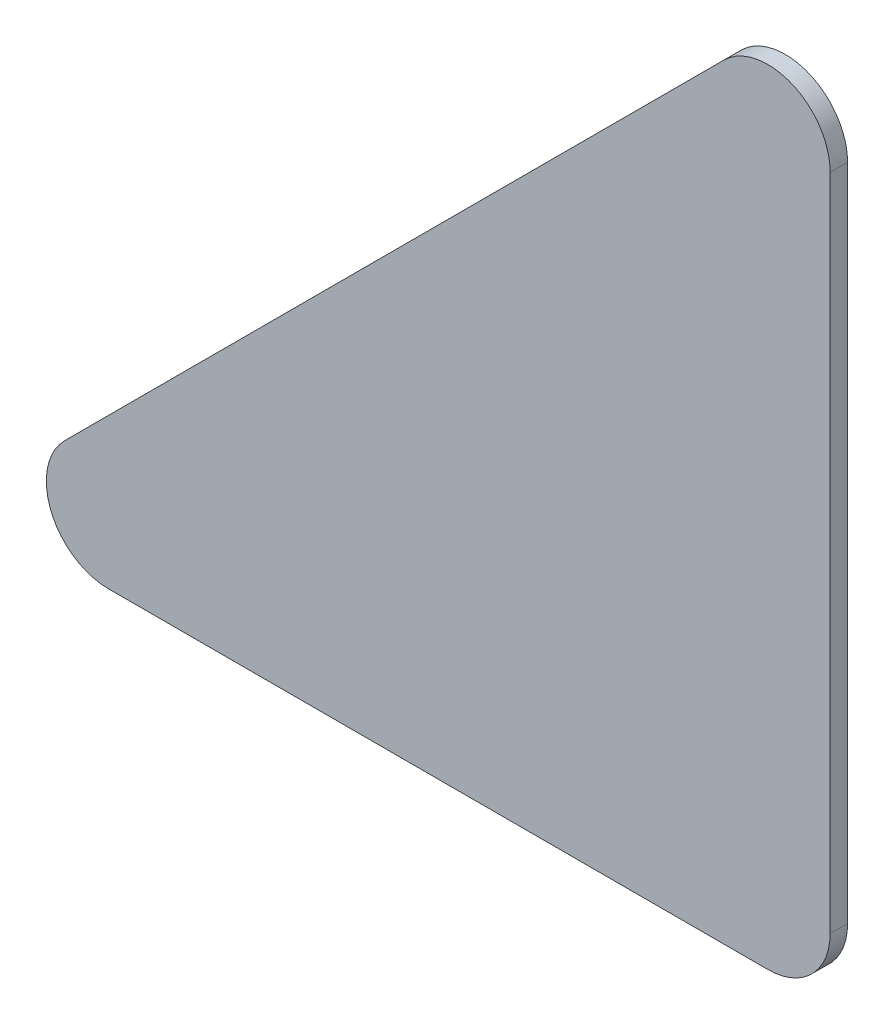
ISO-10303-21;
HEADER;
FILE_DESCRIPTION(('STEP AP214'),'2;1');
FILE_NAME('part.step','',(''),(''),'','','');
FILE_SCHEMA(('AUTOMOTIVE_DESIGN { 1 0 10303 214 1 1 1 1 }'));
ENDSEC;
DATA;
#1=APPLICATION_CONTEXT('core data for automotive mechanical design processes');
#2=APPLICATION_PROTOCOL_DEFINITION('international standard','automotive_design',2000,#1);
#3=PRODUCT_CONTEXT('',#1,'mechanical');
#4=PRODUCT('Part','Part','',(#3));
#5=PRODUCT_RELATED_PRODUCT_CATEGORY('part','',(#4));
#6=PRODUCT_DEFINITION_FORMATION('','',#4);
#7=PRODUCT_DEFINITION_CONTEXT('part definition',#1,'design');
#8=PRODUCT_DEFINITION('design','',#6,#7);
#9=PRODUCT_DEFINITION_SHAPE('','',#8);
#10=(LENGTH_UNIT() NAMED_UNIT(*) SI_UNIT(.MILLI.,.METRE.));
#11=(NAMED_UNIT(*) PLANE_ANGLE_UNIT() SI_UNIT($,.RADIAN.));
#12=(NAMED_UNIT(*) SI_UNIT($,.STERADIAN.) SOLID_ANGLE_UNIT());
#13=UNCERTAINTY_MEASURE_WITH_UNIT(LENGTH_MEASURE(1.E-05),#10,'distance_accuracy_value','');
#14=(GEOMETRIC_REPRESENTATION_CONTEXT(3) GLOBAL_UNCERTAINTY_ASSIGNED_CONTEXT((#13)) GLOBAL_UNIT_ASSIGNED_CONTEXT((#10,
#11,#12)) REPRESENTATION_CONTEXT('',''));
#15=CARTESIAN_POINT('',(0.,0.,0.));
#16=DIRECTION('',(0.,0.,1.));
#17=DIRECTION('',(1.,0.,0.));
#18=AXIS2_PLACEMENT_3D('',#15,#16,#17);
#19=CARTESIAN_POINT('',(-35.,0.,-0.7));
#20=DIRECTION('',(0.,-1.,0.));
#21=DIRECTION('',(0.,0.,-1.));
#22=AXIS2_PLACEMENT_3D('',#19,#20,#21);
#23=PLANE('',#22);
#24=DIRECTION('',(1.,0.,0.));
#25=VECTOR('',#24,1.);
#26=CARTESIAN_POINT('',(-35.,0.,0.));
#27=LINE('',#26,#25);
#28=CARTESIAN_POINT('',(-28.9644660940673,0.,0.));
#29=VERTEX_POINT('',#28);
#30=CARTESIAN_POINT('',(-2.5,0.,0.));
#31=VERTEX_POINT('',#30);
#32=EDGE_CURVE('E141',#29,#31,#27,.T.);
#33=ORIENTED_EDGE('',*,*,#32,.F.);
#34=DIRECTION('',(0.,0.,1.));
#35=VECTOR('',#34,1.);
#36=CARTESIAN_POINT('',(-28.9644660940673,0.,-0.7));
#37=LINE('',#36,#35);
#38=CARTESIAN_POINT('',(-28.9644660940673,0.,-0.7));
#39=VERTEX_POINT('',#38);
#40=EDGE_CURVE('E126',#29,#39,#37,.F.);
#41=ORIENTED_EDGE('',*,*,#40,.T.);
#42=DIRECTION('',(1.,0.,0.));
#43=VECTOR('',#42,1.);
#44=CARTESIAN_POINT('',(-35.,0.,-0.7));
#45=LINE('',#44,#43);
#46=CARTESIAN_POINT('',(-2.5,0.,-0.7));
#47=VERTEX_POINT('',#46);
#48=EDGE_CURVE('E111',#39,#47,#45,.T.);
#49=ORIENTED_EDGE('',*,*,#48,.T.);
#50=DIRECTION('',(0.,0.,1.));
#51=VECTOR('',#50,1.);
#52=CARTESIAN_POINT('',(-2.5,0.,-0.7));
#53=LINE('',#52,#51);
#54=EDGE_CURVE('E123',#47,#31,#53,.T.);
#55=ORIENTED_EDGE('',*,*,#54,.T.);
#56=EDGE_LOOP('',(#33,#41,#49,#55));
#57=FACE_BOUND('',#56,.T.);
#58=ADVANCED_FACE('F39',(#57),#23,.T.);
#59=CARTESIAN_POINT('',(0.,35.,-0.7));
#60=DIRECTION('',(-0.707106781186547,0.707106781186547,0.));
#61=DIRECTION('',(-0.707106781186548,-0.707106781186548,0.));
#62=AXIS2_PLACEMENT_3D('',#59,#60,#61);
#63=PLANE('',#62);
#64=DIRECTION('',(-0.707106781186548,-0.707106781186548,0.));
#65=VECTOR('',#64,1.);
#66=CARTESIAN_POINT('',(0.,35.,-0.7));
#67=LINE('',#66,#65);
#68=CARTESIAN_POINT('',(-4.26776695296637,30.7322330470336,-0.7));
#69=VERTEX_POINT('',#68);
#70=CARTESIAN_POINT('',(-30.7322330470336,4.26776695296636,-0.7));
#71=VERTEX_POINT('',#70);
#72=EDGE_CURVE('E114',#69,#71,#67,.T.);
#73=ORIENTED_EDGE('',*,*,#72,.T.);
#74=DIRECTION('',(0.,0.,1.));
#75=VECTOR('',#74,1.);
#76=CARTESIAN_POINT('',(-30.7322330470336,4.26776695296637,-0.7));
#77=LINE('',#76,#75);
#78=CARTESIAN_POINT('',(-30.7322330470336,4.26776695296636,0.));
#79=VERTEX_POINT('',#78);
#80=EDGE_CURVE('E110',#71,#79,#77,.T.);
#81=ORIENTED_EDGE('',*,*,#80,.T.);
#82=DIRECTION('',(-0.707106781186548,-0.707106781186548,0.));
#83=VECTOR('',#82,1.);
#84=CARTESIAN_POINT('',(0.,35.,0.));
#85=LINE('',#84,#83);
#86=CARTESIAN_POINT('',(-4.26776695296637,30.7322330470336,0.));
#87=VERTEX_POINT('',#86);
#88=EDGE_CURVE('E96',#87,#79,#85,.T.);
#89=ORIENTED_EDGE('',*,*,#88,.F.);
#90=DIRECTION('',(0.,0.,1.));
#91=VECTOR('',#90,1.);
#92=CARTESIAN_POINT('',(-4.26776695296637,30.7322330470336,-0.7));
#93=LINE('',#92,#91);
#94=EDGE_CURVE('E108',#87,#69,#93,.F.);
#95=ORIENTED_EDGE('',*,*,#94,.T.);
#96=EDGE_LOOP('',(#73,#81,#89,#95));
#97=FACE_BOUND('',#96,.T.);
#98=ADVANCED_FACE('F107',(#97),#63,.T.);
#99=CARTESIAN_POINT('',(0.,0.,-0.7));
#100=DIRECTION('',(1.,0.,0.));
#101=DIRECTION('',(0.,0.,-1.));
#102=AXIS2_PLACEMENT_3D('',#99,#100,#101);
#103=PLANE('',#102);
#104=DIRECTION('',(0.,1.,0.));
#105=VECTOR('',#104,1.);
#106=CARTESIAN_POINT('',(0.,0.,-0.7));
#107=LINE('',#106,#105);
#108=CARTESIAN_POINT('',(0.,2.5,-0.7));
#109=VERTEX_POINT('',#108);
#110=CARTESIAN_POINT('',(0.,28.9644660940673,-0.7));
#111=VERTEX_POINT('',#110);
#112=EDGE_CURVE('E117',#109,#111,#107,.T.);
#113=ORIENTED_EDGE('',*,*,#112,.T.);
#114=DIRECTION('',(0.,0.,1.));
#115=VECTOR('',#114,1.);
#116=CARTESIAN_POINT('',(0.,28.9644660940673,-0.7));
#117=LINE('',#116,#115);
#118=CARTESIAN_POINT('',(0.,28.9644660940673,0.));
#119=VERTEX_POINT('',#118);
#120=EDGE_CURVE('E11',#111,#119,#117,.T.);
#121=ORIENTED_EDGE('',*,*,#120,.T.);
#122=DIRECTION('',(0.,1.,0.));
#123=VECTOR('',#122,1.);
#124=CARTESIAN_POINT('',(0.,0.,0.));
#125=LINE('',#124,#123);
#126=CARTESIAN_POINT('',(0.,2.5,0.));
#127=VERTEX_POINT('',#126);
#128=EDGE_CURVE('E97',#127,#119,#125,.T.);
#129=ORIENTED_EDGE('',*,*,#128,.F.);
#130=DIRECTION('',(0.,0.,1.));
#131=VECTOR('',#130,1.);
#132=CARTESIAN_POINT('',(0.,2.5,-0.7));
#133=LINE('',#132,#131);
#134=EDGE_CURVE('E47',#127,#109,#133,.F.);
#135=ORIENTED_EDGE('',*,*,#134,.T.);
#136=EDGE_LOOP('',(#113,#121,#129,#135));
#137=FACE_BOUND('',#136,.T.);
#138=ADVANCED_FACE('F149',(#137),#103,.T.);
#139=CARTESIAN_POINT('',(0.,0.,-0.7));
#140=DIRECTION('',(0.,0.,1.));
#141=DIRECTION('',(1.,0.,0.));
#142=AXIS2_PLACEMENT_3D('',#139,#140,#141);
#143=PLANE('',#142);
#144=ORIENTED_EDGE('',*,*,#48,.F.);
#145=CARTESIAN_POINT('',(-28.9644660940673,2.5,-0.7));
#146=DIRECTION('',(0.,0.,1.));
#147=DIRECTION('',(1.,0.,0.));
#148=AXIS2_PLACEMENT_3D('',#145,#146,#147);
#149=CIRCLE('',#148,2.5);
#150=EDGE_CURVE('E131',#39,#71,#149,.F.);
#151=ORIENTED_EDGE('',*,*,#150,.T.);
#152=ORIENTED_EDGE('',*,*,#72,.F.);
#153=CARTESIAN_POINT('',(-2.5,28.9644660940673,-0.7));
#154=DIRECTION('',(0.,0.,1.));
#155=DIRECTION('',(1.,0.,0.));
#156=AXIS2_PLACEMENT_3D('',#153,#154,#155);
#157=CIRCLE('',#156,2.5);
#158=EDGE_CURVE('E54',#69,#111,#157,.F.);
#159=ORIENTED_EDGE('',*,*,#158,.T.);
#160=ORIENTED_EDGE('',*,*,#112,.F.);
#161=CARTESIAN_POINT('',(-2.5,2.5,-0.7));
#162=DIRECTION('',(0.,0.,1.));
#163=DIRECTION('',(1.,0.,0.));
#164=AXIS2_PLACEMENT_3D('',#161,#162,#163);
#165=CIRCLE('',#164,2.5);
#166=EDGE_CURVE('E128',#109,#47,#165,.F.);
#167=ORIENTED_EDGE('',*,*,#166,.T.);
#168=EDGE_LOOP('',(#144,#151,#152,#159,#160,#167));
#169=FACE_BOUND('',#168,.T.);
#170=ADVANCED_FACE('F134',(#169),#143,.F.);
#171=CARTESIAN_POINT('',(0.,0.,0.));
#172=DIRECTION('',(0.,0.,1.));
#173=DIRECTION('',(1.,0.,0.));
#174=AXIS2_PLACEMENT_3D('',#171,#172,#173);
#175=PLANE('',#174);
#176=ORIENTED_EDGE('',*,*,#88,.T.);
#177=CARTESIAN_POINT('',(-28.9644660940673,2.5,0.));
#178=DIRECTION('',(0.,0.,1.));
#179=DIRECTION('',(1.,0.,0.));
#180=AXIS2_PLACEMENT_3D('',#177,#178,#179);
#181=CIRCLE('',#180,2.5);
#182=EDGE_CURVE('E101',#79,#29,#181,.T.);
#183=ORIENTED_EDGE('',*,*,#182,.T.);
#184=ORIENTED_EDGE('',*,*,#32,.T.);
#185=CARTESIAN_POINT('',(-2.5,2.5,0.));
#186=DIRECTION('',(0.,0.,1.));
#187=DIRECTION('',(1.,0.,0.));
#188=AXIS2_PLACEMENT_3D('',#185,#186,#187);
#189=CIRCLE('',#188,2.5);
#190=EDGE_CURVE('E102',#31,#127,#189,.T.);
#191=ORIENTED_EDGE('',*,*,#190,.T.);
#192=ORIENTED_EDGE('',*,*,#128,.T.);
#193=CARTESIAN_POINT('',(-2.5,28.9644660940673,0.));
#194=DIRECTION('',(0.,0.,1.));
#195=DIRECTION('',(1.,0.,0.));
#196=AXIS2_PLACEMENT_3D('',#193,#194,#195);
#197=CIRCLE('',#196,2.5);
#198=EDGE_CURVE('E93',#119,#87,#197,.T.);
#199=ORIENTED_EDGE('',*,*,#198,.T.);
#200=EDGE_LOOP('',(#176,#183,#184,#191,#192,#199));
#201=FACE_BOUND('',#200,.T.);
#202=ADVANCED_FACE('F95',(#201),#175,.T.);
#203=CARTESIAN_POINT('',(-28.9644660940673,2.5,-0.7));
#204=DIRECTION('',(0.,0.,1.));
#205=DIRECTION('',(1.,0.,0.));
#206=AXIS2_PLACEMENT_3D('',#203,#204,#205);
#207=CYLINDRICAL_SURFACE('',#206,2.5);
#208=ORIENTED_EDGE('',*,*,#150,.F.);
#209=ORIENTED_EDGE('',*,*,#40,.F.);
#210=ORIENTED_EDGE('',*,*,#182,.F.);
#211=ORIENTED_EDGE('',*,*,#80,.F.);
#212=EDGE_LOOP('',(#208,#209,#210,#211));
#213=FACE_BOUND('',#212,.T.);
#214=ADVANCED_FACE('F138',(#213),#207,.T.);
#215=CARTESIAN_POINT('',(-2.5,28.9644660940673,-0.7));
#216=DIRECTION('',(0.,0.,1.));
#217=DIRECTION('',(1.,0.,0.));
#218=AXIS2_PLACEMENT_3D('',#215,#216,#217);
#219=CYLINDRICAL_SURFACE('',#218,2.5);
#220=ORIENTED_EDGE('',*,*,#158,.F.);
#221=ORIENTED_EDGE('',*,*,#94,.F.);
#222=ORIENTED_EDGE('',*,*,#198,.F.);
#223=ORIENTED_EDGE('',*,*,#120,.F.);
#224=EDGE_LOOP('',(#220,#221,#222,#223));
#225=FACE_BOUND('',#224,.T.);
#226=ADVANCED_FACE('F113',(#225),#219,.T.);
#227=CARTESIAN_POINT('',(-2.5,2.5,-0.7));
#228=DIRECTION('',(0.,0.,1.));
#229=DIRECTION('',(1.,0.,0.));
#230=AXIS2_PLACEMENT_3D('',#227,#228,#229);
#231=CYLINDRICAL_SURFACE('',#230,2.5);
#232=ORIENTED_EDGE('',*,*,#166,.F.);
#233=ORIENTED_EDGE('',*,*,#134,.F.);
#234=ORIENTED_EDGE('',*,*,#190,.F.);
#235=ORIENTED_EDGE('',*,*,#54,.F.);
#236=EDGE_LOOP('',(#232,#233,#234,#235));
#237=FACE_BOUND('',#236,.T.);
#238=ADVANCED_FACE('F41',(#237),#231,.T.);
#239=CLOSED_SHELL('',(#58,#98,#138,#170,#202,#214,#226,#238));
#240=MANIFOLD_SOLID_BREP('B2',#239);
#241=ADVANCED_BREP_SHAPE_REPRESENTATION('',(#18,#240),#14);
#242=SHAPE_DEFINITION_REPRESENTATION(#9,#241);
ENDSEC;
END-ISO-10303-21;
